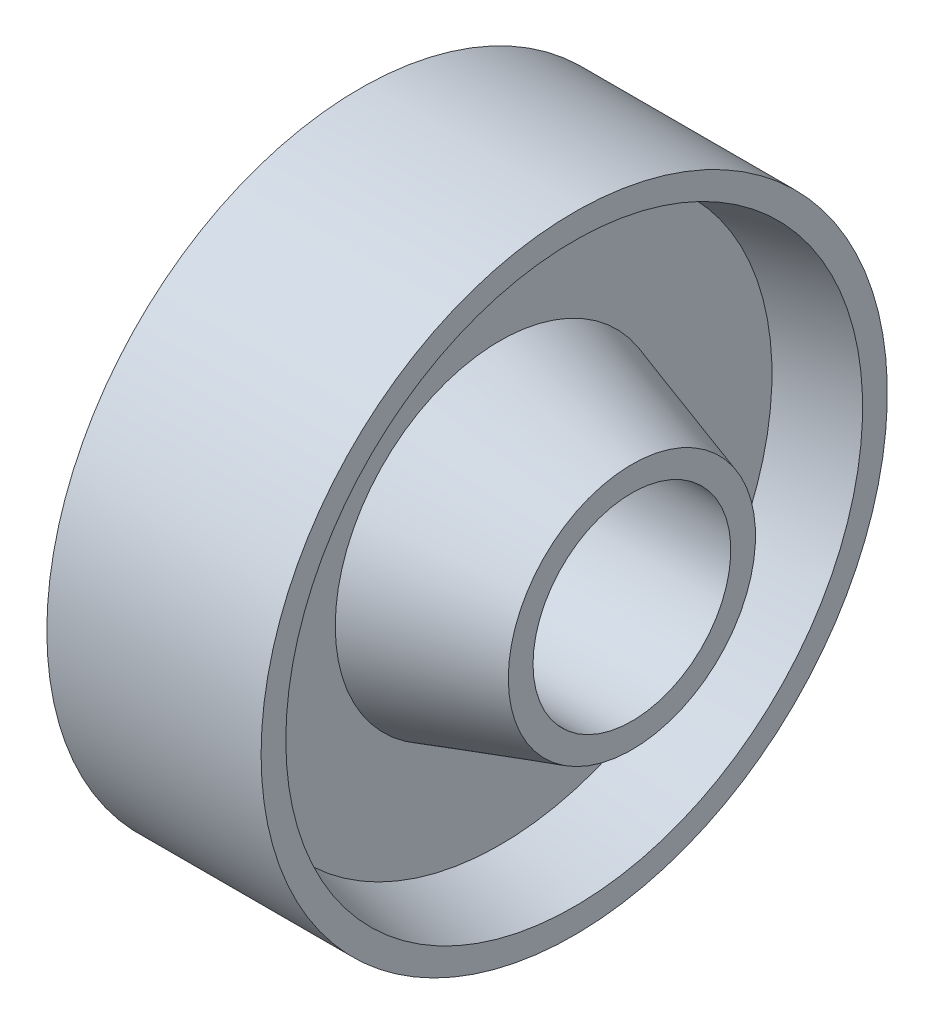
ISO-10303-21;
HEADER;
FILE_DESCRIPTION(('STEP AP214'),'2;1');
FILE_NAME('part.step','',(''),(''),'','','');
FILE_SCHEMA(('AUTOMOTIVE_DESIGN { 1 0 10303 214 1 1 1 1 }'));
ENDSEC;
DATA;
#1=APPLICATION_CONTEXT('core data for automotive mechanical design processes');
#2=APPLICATION_PROTOCOL_DEFINITION('international standard','automotive_design',2000,#1);
#3=PRODUCT_CONTEXT('',#1,'mechanical');
#4=PRODUCT('Part','Part','',(#3));
#5=PRODUCT_RELATED_PRODUCT_CATEGORY('part','',(#4));
#6=PRODUCT_DEFINITION_FORMATION('','',#4);
#7=PRODUCT_DEFINITION_CONTEXT('part definition',#1,'design');
#8=PRODUCT_DEFINITION('design','',#6,#7);
#9=PRODUCT_DEFINITION_SHAPE('','',#8);
#10=(LENGTH_UNIT() NAMED_UNIT(*) SI_UNIT(.MILLI.,.METRE.));
#11=(NAMED_UNIT(*) PLANE_ANGLE_UNIT() SI_UNIT($,.RADIAN.));
#12=(NAMED_UNIT(*) SI_UNIT($,.STERADIAN.) SOLID_ANGLE_UNIT());
#13=UNCERTAINTY_MEASURE_WITH_UNIT(LENGTH_MEASURE(1.E-05),#10,'distance_accuracy_value','');
#14=(GEOMETRIC_REPRESENTATION_CONTEXT(3) GLOBAL_UNCERTAINTY_ASSIGNED_CONTEXT((#13)) GLOBAL_UNIT_ASSIGNED_CONTEXT((#10,
#11,#12)) REPRESENTATION_CONTEXT('',''));
#15=CARTESIAN_POINT('',(0.,0.,0.));
#16=DIRECTION('',(0.,0.,1.));
#17=DIRECTION('',(1.,0.,0.));
#18=AXIS2_PLACEMENT_3D('',#15,#16,#17);
#19=CARTESIAN_POINT('',(26.1965028756295,0.,-12.));
#20=DIRECTION('',(1.,0.,0.));
#21=DIRECTION('',(0.,0.,-1.));
#22=AXIS2_PLACEMENT_3D('',#19,#20,#21);
#23=PLANE('',#22);
#24=CARTESIAN_POINT('',(26.1965028756295,0.,0.));
#25=DIRECTION('',(-1.,0.,0.));
#26=DIRECTION('',(0.,0.,1.));
#27=AXIS2_PLACEMENT_3D('',#24,#25,#26);
#28=CIRCLE('',#27,12.);
#29=CARTESIAN_POINT('',(26.1965028756295,0.,12.));
#30=VERTEX_POINT('',#29);
#31=EDGE_CURVE('E74',#30,#30,#28,.T.);
#32=ORIENTED_EDGE('',*,*,#31,.F.);
#33=EDGE_LOOP('',(#32));
#34=FACE_BOUND('',#33,.T.);
#35=CARTESIAN_POINT('',(26.1965028756295,0.,0.));
#36=DIRECTION('',(-1.,0.,0.));
#37=DIRECTION('',(0.,0.,1.));
#38=AXIS2_PLACEMENT_3D('',#35,#36,#37);
#39=CIRCLE('',#38,15.);
#40=CARTESIAN_POINT('',(26.1965028756295,0.,15.));
#41=VERTEX_POINT('',#40);
#42=EDGE_CURVE('E10',#41,#41,#39,.T.);
#43=ORIENTED_EDGE('',*,*,#42,.T.);
#44=EDGE_LOOP('',(#43));
#45=FACE_BOUND('',#44,.T.);
#46=ADVANCED_FACE('F34',(#34,#45),#23,.F.);
#47=CARTESIAN_POINT('',(42.1965028756295,0.,0.));
#48=DIRECTION('',(1.,0.,0.));
#49=DIRECTION('',(0.,0.,-1.));
#50=AXIS2_PLACEMENT_3D('',#47,#48,#49);
#51=CONICAL_SURFACE('',#50,20.,0.302884868374972);
#52=ORIENTED_EDGE('',*,*,#42,.F.);
#53=EDGE_LOOP('',(#52));
#54=FACE_BOUND('',#53,.T.);
#55=CARTESIAN_POINT('',(42.1965028756295,0.,0.));
#56=DIRECTION('',(-1.,0.,0.));
#57=DIRECTION('',(0.,0.,1.));
#58=AXIS2_PLACEMENT_3D('',#55,#56,#57);
#59=CIRCLE('',#58,20.);
#60=CARTESIAN_POINT('',(42.1965028756295,0.,20.));
#61=VERTEX_POINT('',#60);
#62=EDGE_CURVE('E40',#61,#61,#59,.T.);
#63=ORIENTED_EDGE('',*,*,#62,.T.);
#64=EDGE_LOOP('',(#63));
#65=FACE_BOUND('',#64,.T.);
#66=ADVANCED_FACE('F81',(#54,#65),#51,.T.);
#67=CARTESIAN_POINT('',(42.1965028756295,0.,-20.));
#68=DIRECTION('',(1.,0.,0.));
#69=DIRECTION('',(0.,0.,-1.));
#70=AXIS2_PLACEMENT_3D('',#67,#68,#69);
#71=PLANE('',#70);
#72=ORIENTED_EDGE('',*,*,#62,.F.);
#73=EDGE_LOOP('',(#72));
#74=FACE_BOUND('',#73,.T.);
#75=CARTESIAN_POINT('',(42.1965028756295,0.,0.));
#76=DIRECTION('',(-1.,0.,0.));
#77=DIRECTION('',(0.,0.,1.));
#78=AXIS2_PLACEMENT_3D('',#75,#76,#77);
#79=CIRCLE('',#78,33.);
#80=CARTESIAN_POINT('',(42.1965028756295,0.,33.));
#81=VERTEX_POINT('',#80);
#82=EDGE_CURVE('E44',#81,#81,#79,.T.);
#83=ORIENTED_EDGE('',*,*,#82,.T.);
#84=EDGE_LOOP('',(#83));
#85=FACE_BOUND('',#84,.T.);
#86=ADVANCED_FACE('F85',(#74,#85),#71,.F.);
#87=CARTESIAN_POINT('',(33.1965028756295,0.,0.));
#88=DIRECTION('',(-1.,0.,0.));
#89=DIRECTION('',(0.,0.,1.));
#90=AXIS2_PLACEMENT_3D('',#87,#88,#89);
#91=CONICAL_SURFACE('',#90,35.,0.218668945873942);
#92=ORIENTED_EDGE('',*,*,#82,.F.);
#93=EDGE_LOOP('',(#92));
#94=FACE_BOUND('',#93,.T.);
#95=CARTESIAN_POINT('',(33.1965028756295,0.,0.));
#96=DIRECTION('',(-1.,0.,0.));
#97=DIRECTION('',(0.,0.,1.));
#98=AXIS2_PLACEMENT_3D('',#95,#96,#97);
#99=CIRCLE('',#98,35.);
#100=CARTESIAN_POINT('',(33.1965028756295,0.,35.));
#101=VERTEX_POINT('',#100);
#102=EDGE_CURVE('E48',#101,#101,#99,.T.);
#103=ORIENTED_EDGE('',*,*,#102,.T.);
#104=EDGE_LOOP('',(#103));
#105=FACE_BOUND('',#104,.T.);
#106=ADVANCED_FACE('F90',(#94,#105),#91,.F.);
#107=CARTESIAN_POINT('',(33.1965028756295,0.,-38.));
#108=DIRECTION('',(1.,0.,0.));
#109=DIRECTION('',(0.,0.,-1.));
#110=AXIS2_PLACEMENT_3D('',#107,#108,#109);
#111=PLANE('',#110);
#112=ORIENTED_EDGE('',*,*,#102,.F.);
#113=EDGE_LOOP('',(#112));
#114=FACE_BOUND('',#113,.T.);
#115=CARTESIAN_POINT('',(33.1965028756295,0.,0.));
#116=DIRECTION('',(-1.,0.,0.));
#117=DIRECTION('',(0.,0.,1.));
#118=AXIS2_PLACEMENT_3D('',#115,#116,#117);
#119=CIRCLE('',#118,38.);
#120=CARTESIAN_POINT('',(33.1965028756295,0.,38.));
#121=VERTEX_POINT('',#120);
#122=EDGE_CURVE('E53',#121,#121,#119,.T.);
#123=ORIENTED_EDGE('',*,*,#122,.T.);
#124=EDGE_LOOP('',(#123));
#125=FACE_BOUND('',#124,.T.);
#126=ADVANCED_FACE('F96',(#114,#125),#111,.F.);
#127=CARTESIAN_POINT('',(0.,0.,0.));
#128=DIRECTION('',(-1.,0.,0.));
#129=DIRECTION('',(0.,0.,1.));
#130=AXIS2_PLACEMENT_3D('',#127,#128,#129);
#131=CYLINDRICAL_SURFACE('',#130,38.);
#132=ORIENTED_EDGE('',*,*,#122,.F.);
#133=EDGE_LOOP('',(#132));
#134=FACE_BOUND('',#133,.T.);
#135=CARTESIAN_POINT('',(59.1965028756295,0.,0.));
#136=DIRECTION('',(-1.,0.,0.));
#137=DIRECTION('',(0.,0.,1.));
#138=AXIS2_PLACEMENT_3D('',#135,#136,#137);
#139=CIRCLE('',#138,38.);
#140=CARTESIAN_POINT('',(59.1965028756295,0.,38.));
#141=VERTEX_POINT('',#140);
#142=EDGE_CURVE('E56',#141,#141,#139,.T.);
#143=ORIENTED_EDGE('',*,*,#142,.T.);
#144=EDGE_LOOP('',(#143));
#145=FACE_BOUND('',#144,.T.);
#146=ADVANCED_FACE('F100',(#134,#145),#131,.T.);
#147=CARTESIAN_POINT('',(59.1965028756295,0.,-38.));
#148=DIRECTION('',(-1.,0.,0.));
#149=DIRECTION('',(0.,0.,1.));
#150=AXIS2_PLACEMENT_3D('',#147,#148,#149);
#151=PLANE('',#150);
#152=ORIENTED_EDGE('',*,*,#142,.F.);
#153=EDGE_LOOP('',(#152));
#154=FACE_BOUND('',#153,.T.);
#155=CARTESIAN_POINT('',(59.1965028756295,0.,0.));
#156=DIRECTION('',(-1.,0.,0.));
#157=DIRECTION('',(0.,0.,1.));
#158=AXIS2_PLACEMENT_3D('',#155,#156,#157);
#159=CIRCLE('',#158,35.);
#160=CARTESIAN_POINT('',(59.1965028756295,0.,35.));
#161=VERTEX_POINT('',#160);
#162=EDGE_CURVE('E59',#161,#161,#159,.T.);
#163=ORIENTED_EDGE('',*,*,#162,.T.);
#164=EDGE_LOOP('',(#163));
#165=FACE_BOUND('',#164,.T.);
#166=ADVANCED_FACE('F104',(#154,#165),#151,.F.);
#167=CARTESIAN_POINT('',(50.1965028756295,0.,0.));
#168=DIRECTION('',(1.,0.,0.));
#169=DIRECTION('',(0.,0.,-1.));
#170=AXIS2_PLACEMENT_3D('',#167,#168,#169);
#171=CONICAL_SURFACE('',#170,33.,0.218668945873942);
#172=ORIENTED_EDGE('',*,*,#162,.F.);
#173=EDGE_LOOP('',(#172));
#174=FACE_BOUND('',#173,.T.);
#175=CARTESIAN_POINT('',(50.1965028756295,0.,0.));
#176=DIRECTION('',(-1.,0.,0.));
#177=DIRECTION('',(0.,0.,1.));
#178=AXIS2_PLACEMENT_3D('',#175,#176,#177);
#179=CIRCLE('',#178,33.);
#180=CARTESIAN_POINT('',(50.1965028756295,0.,33.));
#181=VERTEX_POINT('',#180);
#182=EDGE_CURVE('E62',#181,#181,#179,.T.);
#183=ORIENTED_EDGE('',*,*,#182,.T.);
#184=EDGE_LOOP('',(#183));
#185=FACE_BOUND('',#184,.T.);
#186=ADVANCED_FACE('F108',(#174,#185),#171,.F.);
#187=CARTESIAN_POINT('',(50.1965028756295,0.,-20.));
#188=DIRECTION('',(-1.,0.,0.));
#189=DIRECTION('',(0.,0.,1.));
#190=AXIS2_PLACEMENT_3D('',#187,#188,#189);
#191=PLANE('',#190);
#192=ORIENTED_EDGE('',*,*,#182,.F.);
#193=EDGE_LOOP('',(#192));
#194=FACE_BOUND('',#193,.T.);
#195=CARTESIAN_POINT('',(50.1965028756295,0.,0.));
#196=DIRECTION('',(-1.,0.,0.));
#197=DIRECTION('',(0.,0.,1.));
#198=AXIS2_PLACEMENT_3D('',#195,#196,#197);
#199=CIRCLE('',#198,20.);
#200=CARTESIAN_POINT('',(50.1965028756295,0.,20.));
#201=VERTEX_POINT('',#200);
#202=EDGE_CURVE('E65',#201,#201,#199,.T.);
#203=ORIENTED_EDGE('',*,*,#202,.T.);
#204=EDGE_LOOP('',(#203));
#205=FACE_BOUND('',#204,.T.);
#206=ADVANCED_FACE('F112',(#194,#205),#191,.F.);
#207=CARTESIAN_POINT('',(66.1965028756295,0.,0.));
#208=DIRECTION('',(-1.,0.,0.));
#209=DIRECTION('',(0.,0.,1.));
#210=AXIS2_PLACEMENT_3D('',#207,#208,#209);
#211=CONICAL_SURFACE('',#210,15.,0.302884868374971);
#212=ORIENTED_EDGE('',*,*,#202,.F.);
#213=EDGE_LOOP('',(#212));
#214=FACE_BOUND('',#213,.T.);
#215=CARTESIAN_POINT('',(66.1965028756295,0.,0.));
#216=DIRECTION('',(-1.,0.,0.));
#217=DIRECTION('',(0.,0.,1.));
#218=AXIS2_PLACEMENT_3D('',#215,#216,#217);
#219=CIRCLE('',#218,15.);
#220=CARTESIAN_POINT('',(66.1965028756295,0.,15.));
#221=VERTEX_POINT('',#220);
#222=EDGE_CURVE('E68',#221,#221,#219,.T.);
#223=ORIENTED_EDGE('',*,*,#222,.T.);
#224=EDGE_LOOP('',(#223));
#225=FACE_BOUND('',#224,.T.);
#226=ADVANCED_FACE('F116',(#214,#225),#211,.T.);
#227=CARTESIAN_POINT('',(66.1965028756295,0.,-12.));
#228=DIRECTION('',(-1.,0.,0.));
#229=DIRECTION('',(0.,0.,1.));
#230=AXIS2_PLACEMENT_3D('',#227,#228,#229);
#231=PLANE('',#230);
#232=ORIENTED_EDGE('',*,*,#222,.F.);
#233=EDGE_LOOP('',(#232));
#234=FACE_BOUND('',#233,.T.);
#235=CARTESIAN_POINT('',(66.1965028756295,0.,0.));
#236=DIRECTION('',(-1.,0.,0.));
#237=DIRECTION('',(0.,0.,1.));
#238=AXIS2_PLACEMENT_3D('',#235,#236,#237);
#239=CIRCLE('',#238,12.);
#240=CARTESIAN_POINT('',(66.1965028756295,0.,12.));
#241=VERTEX_POINT('',#240);
#242=EDGE_CURVE('E71',#241,#241,#239,.T.);
#243=ORIENTED_EDGE('',*,*,#242,.T.);
#244=EDGE_LOOP('',(#243));
#245=FACE_BOUND('',#244,.T.);
#246=ADVANCED_FACE('F120',(#234,#245),#231,.F.);
#247=CARTESIAN_POINT('',(0.,0.,0.));
#248=DIRECTION('',(-1.,0.,0.));
#249=DIRECTION('',(0.,0.,1.));
#250=AXIS2_PLACEMENT_3D('',#247,#248,#249);
#251=CYLINDRICAL_SURFACE('',#250,12.);
#252=ORIENTED_EDGE('',*,*,#242,.F.);
#253=EDGE_LOOP('',(#252));
#254=FACE_BOUND('',#253,.T.);
#255=ORIENTED_EDGE('',*,*,#31,.T.);
#256=EDGE_LOOP('',(#255));
#257=FACE_BOUND('',#256,.T.);
#258=ADVANCED_FACE('F78',(#254,#257),#251,.F.);
#259=CLOSED_SHELL('',(#46,#66,#86,#106,#126,#146,#166,#186,#206,#226,#246,#258));
#260=MANIFOLD_SOLID_BREP('B2',#259);
#261=ADVANCED_BREP_SHAPE_REPRESENTATION('',(#18,#260),#14);
#262=SHAPE_DEFINITION_REPRESENTATION(#9,#261);
ENDSEC;
END-ISO-10303-21;
